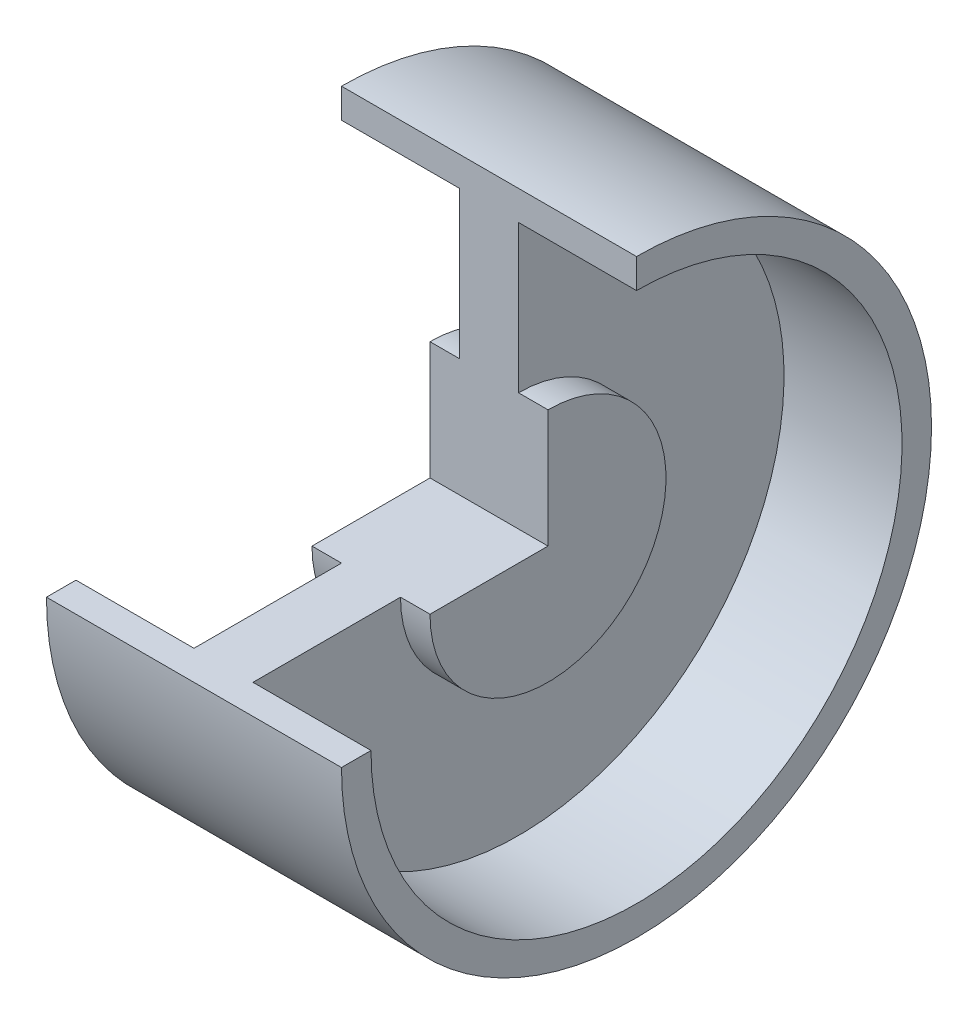
ISO-10303-21;
HEADER;
FILE_DESCRIPTION(('STEP AP214'),'2;1');
FILE_NAME('part.step','',(''),(''),'','','');
FILE_SCHEMA(('AUTOMOTIVE_DESIGN { 1 0 10303 214 1 1 1 1 }'));
ENDSEC;
DATA;
#1=APPLICATION_CONTEXT('core data for automotive mechanical design processes');
#2=APPLICATION_PROTOCOL_DEFINITION('international standard','automotive_design',2000,#1);
#3=PRODUCT_CONTEXT('',#1,'mechanical');
#4=PRODUCT('Part','Part','',(#3));
#5=PRODUCT_RELATED_PRODUCT_CATEGORY('part','',(#4));
#6=PRODUCT_DEFINITION_FORMATION('','',#4);
#7=PRODUCT_DEFINITION_CONTEXT('part definition',#1,'design');
#8=PRODUCT_DEFINITION('design','',#6,#7);
#9=PRODUCT_DEFINITION_SHAPE('','',#8);
#10=(LENGTH_UNIT() NAMED_UNIT(*) SI_UNIT(.MILLI.,.METRE.));
#11=(NAMED_UNIT(*) PLANE_ANGLE_UNIT() SI_UNIT($,.RADIAN.));
#12=(NAMED_UNIT(*) SI_UNIT($,.STERADIAN.) SOLID_ANGLE_UNIT());
#13=UNCERTAINTY_MEASURE_WITH_UNIT(LENGTH_MEASURE(1.E-05),#10,'distance_accuracy_value','');
#14=(GEOMETRIC_REPRESENTATION_CONTEXT(3) GLOBAL_UNCERTAINTY_ASSIGNED_CONTEXT((#13)) GLOBAL_UNIT_ASSIGNED_CONTEXT((#10,
#11,#12)) REPRESENTATION_CONTEXT('',''));
#15=CARTESIAN_POINT('',(0.,0.,0.));
#16=DIRECTION('',(0.,0.,1.));
#17=DIRECTION('',(1.,0.,0.));
#18=AXIS2_PLACEMENT_3D('',#15,#16,#17);
#19=CARTESIAN_POINT('',(9.99999999999999,0.,0.));
#20=DIRECTION('',(1.,0.,0.));
#21=DIRECTION('',(0.,1.,0.));
#22=AXIS2_PLACEMENT_3D('',#19,#20,#21);
#23=PLANE('',#22);
#24=CARTESIAN_POINT('',(9.99999999999998,0.,0.));
#25=DIRECTION('',(1.,0.,0.));
#26=DIRECTION('',(0.,1.,0.));
#27=AXIS2_PLACEMENT_3D('',#24,#25,#26);
#28=CIRCLE('',#27,20.);
#29=CARTESIAN_POINT('',(9.99999999999998,2.09488880330588E-13,20.));
#30=VERTEX_POINT('',#29);
#31=CARTESIAN_POINT('',(10.,20.,0.));
#32=VERTEX_POINT('',#31);
#33=EDGE_CURVE('E11',#30,#32,#28,.T.);
#34=ORIENTED_EDGE('',*,*,#33,.T.);
#35=DIRECTION('',(0.,1.,0.));
#36=VECTOR('',#35,1.);
#37=CARTESIAN_POINT('',(10.,0.,0.));
#38=LINE('',#37,#36);
#39=CARTESIAN_POINT('',(10.,0.,0.));
#40=VERTEX_POINT('',#39);
#41=EDGE_CURVE('E48',#40,#32,#38,.T.);
#42=ORIENTED_EDGE('',*,*,#41,.F.);
#43=DIRECTION('',(0.,0.,1.));
#44=VECTOR('',#43,1.);
#45=CARTESIAN_POINT('',(10.,0.,0.));
#46=LINE('',#45,#44);
#47=EDGE_CURVE('E115',#40,#30,#46,.T.);
#48=ORIENTED_EDGE('',*,*,#47,.T.);
#49=EDGE_LOOP('',(#34,#42,#48));
#50=FACE_BOUND('',#49,.T.);
#51=ADVANCED_FACE('F34',(#50),#23,.T.);
#52=CARTESIAN_POINT('',(-10.,0.,0.));
#53=DIRECTION('',(1.,0.,0.));
#54=DIRECTION('',(0.,1.,0.));
#55=AXIS2_PLACEMENT_3D('',#52,#53,#54);
#56=CYLINDRICAL_SURFACE('',#55,20.);
#57=CARTESIAN_POINT('',(4.99999999999998,0.,0.));
#58=DIRECTION('',(1.,0.,0.));
#59=DIRECTION('',(0.,1.,0.));
#60=AXIS2_PLACEMENT_3D('',#57,#58,#59);
#61=CIRCLE('',#60,20.);
#62=CARTESIAN_POINT('',(4.99999999999998,2.16427774234495E-13,20.));
#63=VERTEX_POINT('',#62);
#64=CARTESIAN_POINT('',(5.,20.,0.));
#65=VERTEX_POINT('',#64);
#66=EDGE_CURVE('E42',#63,#65,#61,.T.);
#67=ORIENTED_EDGE('',*,*,#66,.T.);
#68=DIRECTION('',(-1.,0.,0.));
#69=VECTOR('',#68,1.);
#70=CARTESIAN_POINT('',(10.,20.,0.));
#71=LINE('',#70,#69);
#72=EDGE_CURVE('E124',#32,#65,#71,.T.);
#73=ORIENTED_EDGE('',*,*,#72,.F.);
#74=ORIENTED_EDGE('',*,*,#33,.F.);
#75=DIRECTION('',(-1.,0.,0.));
#76=VECTOR('',#75,1.);
#77=CARTESIAN_POINT('',(9.99999999999998,2.09488880330588E-13,20.));
#78=LINE('',#77,#76);
#79=EDGE_CURVE('E155',#30,#63,#78,.T.);
#80=ORIENTED_EDGE('',*,*,#79,.T.);
#81=EDGE_LOOP('',(#67,#73,#74,#80));
#82=FACE_BOUND('',#81,.T.);
#83=ADVANCED_FACE('F36',(#82),#56,.T.);
#84=CARTESIAN_POINT('',(4.99999999999996,2.16427774234495E-13,20.));
#85=DIRECTION('',(1.,0.,0.));
#86=DIRECTION('',(0.,1.,0.));
#87=AXIS2_PLACEMENT_3D('',#84,#85,#86);
#88=PLANE('',#87);
#89=CARTESIAN_POINT('',(4.99999999999994,0.,0.));
#90=DIRECTION('',(1.,0.,0.));
#91=DIRECTION('',(0.,1.,0.));
#92=AXIS2_PLACEMENT_3D('',#89,#90,#91);
#93=CIRCLE('',#92,45.);
#94=CARTESIAN_POINT('',(4.99999999999994,4.7828887464773E-13,45.));
#95=VERTEX_POINT('',#94);
#96=CARTESIAN_POINT('',(5.,45.,0.));
#97=VERTEX_POINT('',#96);
#98=EDGE_CURVE('E199',#95,#97,#93,.T.);
#99=ORIENTED_EDGE('',*,*,#98,.T.);
#100=DIRECTION('',(0.,1.,0.));
#101=VECTOR('',#100,1.);
#102=CARTESIAN_POINT('',(5.,20.,0.));
#103=LINE('',#102,#101);
#104=EDGE_CURVE('E127',#65,#97,#103,.T.);
#105=ORIENTED_EDGE('',*,*,#104,.F.);
#106=ORIENTED_EDGE('',*,*,#66,.F.);
#107=DIRECTION('',(0.,0.,1.));
#108=VECTOR('',#107,1.);
#109=CARTESIAN_POINT('',(4.99999999999998,2.16427774234495E-13,20.));
#110=LINE('',#109,#108);
#111=EDGE_CURVE('E157',#63,#95,#110,.T.);
#112=ORIENTED_EDGE('',*,*,#111,.T.);
#113=EDGE_LOOP('',(#99,#105,#106,#112));
#114=FACE_BOUND('',#113,.T.);
#115=ADVANCED_FACE('F201',(#114),#88,.T.);
#116=CARTESIAN_POINT('',(-10.,0.,0.));
#117=DIRECTION('',(1.,0.,0.));
#118=DIRECTION('',(0.,1.,0.));
#119=AXIS2_PLACEMENT_3D('',#116,#117,#118);
#120=CYLINDRICAL_SURFACE('',#119,45.);
#121=CARTESIAN_POINT('',(24.9999999999999,0.,0.));
#122=DIRECTION('',(1.,0.,0.));
#123=DIRECTION('',(0.,1.,0.));
#124=AXIS2_PLACEMENT_3D('',#121,#122,#123);
#125=CIRCLE('',#124,45.);
#126=CARTESIAN_POINT('',(24.9999999999999,4.50533299032102E-13,45.));
#127=VERTEX_POINT('',#126);
#128=CARTESIAN_POINT('',(25.,45.,0.));
#129=VERTEX_POINT('',#128);
#130=EDGE_CURVE('E197',#127,#129,#125,.T.);
#131=ORIENTED_EDGE('',*,*,#130,.T.);
#132=DIRECTION('',(1.,0.,0.));
#133=VECTOR('',#132,1.);
#134=CARTESIAN_POINT('',(5.,45.,0.));
#135=LINE('',#134,#133);
#136=EDGE_CURVE('E129',#97,#129,#135,.T.);
#137=ORIENTED_EDGE('',*,*,#136,.F.);
#138=ORIENTED_EDGE('',*,*,#98,.F.);
#139=DIRECTION('',(1.,0.,0.));
#140=VECTOR('',#139,1.);
#141=CARTESIAN_POINT('',(4.99999999999994,4.7828887464773E-13,45.));
#142=LINE('',#141,#140);
#143=EDGE_CURVE('E160',#95,#127,#142,.T.);
#144=ORIENTED_EDGE('',*,*,#143,.T.);
#145=EDGE_LOOP('',(#131,#137,#138,#144));
#146=FACE_BOUND('',#145,.T.);
#147=ADVANCED_FACE('F207',(#146),#120,.F.);
#148=CARTESIAN_POINT('',(24.9999999999999,4.50533299032102E-13,45.));
#149=DIRECTION('',(1.,0.,0.));
#150=DIRECTION('',(0.,1.,0.));
#151=AXIS2_PLACEMENT_3D('',#148,#149,#150);
#152=PLANE('',#151);
#153=CARTESIAN_POINT('',(24.9999999999999,0.,0.));
#154=DIRECTION('',(1.,0.,0.));
#155=DIRECTION('',(0.,1.,0.));
#156=AXIS2_PLACEMENT_3D('',#153,#154,#155);
#157=CIRCLE('',#156,50.);
#158=CARTESIAN_POINT('',(24.9999999999999,5.02905519114749E-13,50.));
#159=VERTEX_POINT('',#158);
#160=CARTESIAN_POINT('',(25.,50.,0.));
#161=VERTEX_POINT('',#160);
#162=EDGE_CURVE('E195',#159,#161,#157,.T.);
#163=ORIENTED_EDGE('',*,*,#162,.T.);
#164=DIRECTION('',(0.,1.,0.));
#165=VECTOR('',#164,1.);
#166=CARTESIAN_POINT('',(25.,45.,0.));
#167=LINE('',#166,#165);
#168=EDGE_CURVE('E134',#129,#161,#167,.T.);
#169=ORIENTED_EDGE('',*,*,#168,.F.);
#170=ORIENTED_EDGE('',*,*,#130,.F.);
#171=DIRECTION('',(0.,0.,1.));
#172=VECTOR('',#171,1.);
#173=CARTESIAN_POINT('',(24.9999999999999,4.50533299032102E-13,45.));
#174=LINE('',#173,#172);
#175=EDGE_CURVE('E163',#127,#159,#174,.T.);
#176=ORIENTED_EDGE('',*,*,#175,.T.);
#177=EDGE_LOOP('',(#163,#169,#170,#176));
#178=FACE_BOUND('',#177,.T.);
#179=ADVANCED_FACE('F210',(#178),#152,.T.);
#180=CARTESIAN_POINT('',(-10.,0.,0.));
#181=DIRECTION('',(1.,0.,0.));
#182=DIRECTION('',(0.,1.,0.));
#183=AXIS2_PLACEMENT_3D('',#180,#181,#182);
#184=CYLINDRICAL_SURFACE('',#183,50.);
#185=CARTESIAN_POINT('',(-25.0000000000001,0.,0.));
#186=DIRECTION('',(1.,0.,0.));
#187=DIRECTION('',(0.,1.,0.));
#188=AXIS2_PLACEMENT_3D('',#185,#186,#187);
#189=CIRCLE('',#188,50.);
#190=CARTESIAN_POINT('',(-25.0000000000001,5.7229445815382E-13,50.));
#191=VERTEX_POINT('',#190);
#192=CARTESIAN_POINT('',(-25.,50.,0.));
#193=VERTEX_POINT('',#192);
#194=EDGE_CURVE('E193',#191,#193,#189,.T.);
#195=ORIENTED_EDGE('',*,*,#194,.T.);
#196=DIRECTION('',(-1.,0.,0.));
#197=VECTOR('',#196,1.);
#198=CARTESIAN_POINT('',(25.,50.,0.));
#199=LINE('',#198,#197);
#200=EDGE_CURVE('E137',#161,#193,#199,.T.);
#201=ORIENTED_EDGE('',*,*,#200,.F.);
#202=ORIENTED_EDGE('',*,*,#162,.F.);
#203=DIRECTION('',(-1.,0.,0.));
#204=VECTOR('',#203,1.);
#205=CARTESIAN_POINT('',(24.9999999999999,5.02905519114749E-13,50.));
#206=LINE('',#205,#204);
#207=EDGE_CURVE('E166',#159,#191,#206,.T.);
#208=ORIENTED_EDGE('',*,*,#207,.T.);
#209=EDGE_LOOP('',(#195,#201,#202,#208));
#210=FACE_BOUND('',#209,.T.);
#211=ADVANCED_FACE('F215',(#210),#184,.T.);
#212=CARTESIAN_POINT('',(-25.0000000000001,5.19922238071173E-13,45.));
#213=DIRECTION('',(-1.,0.,0.));
#214=DIRECTION('',(0.,-1.,0.));
#215=AXIS2_PLACEMENT_3D('',#212,#213,#214);
#216=PLANE('',#215);
#217=CARTESIAN_POINT('',(-25.0000000000001,0.,0.));
#218=DIRECTION('',(1.,0.,0.));
#219=DIRECTION('',(0.,1.,0.));
#220=AXIS2_PLACEMENT_3D('',#217,#218,#219);
#221=CIRCLE('',#220,45.);
#222=CARTESIAN_POINT('',(-25.0000000000001,5.19922238071173E-13,45.));
#223=VERTEX_POINT('',#222);
#224=CARTESIAN_POINT('',(-25.,45.,0.));
#225=VERTEX_POINT('',#224);
#226=EDGE_CURVE('E191',#223,#225,#221,.T.);
#227=ORIENTED_EDGE('',*,*,#226,.T.);
#228=DIRECTION('',(0.,-1.,0.));
#229=VECTOR('',#228,1.);
#230=CARTESIAN_POINT('',(-25.,45.,0.));
#231=LINE('',#230,#229);
#232=EDGE_CURVE('E140',#193,#225,#231,.T.);
#233=ORIENTED_EDGE('',*,*,#232,.F.);
#234=ORIENTED_EDGE('',*,*,#194,.F.);
#235=DIRECTION('',(0.,0.,-1.));
#236=VECTOR('',#235,1.);
#237=CARTESIAN_POINT('',(-25.0000000000001,5.19922238071173E-13,45.));
#238=LINE('',#237,#236);
#239=EDGE_CURVE('E169',#191,#223,#238,.T.);
#240=ORIENTED_EDGE('',*,*,#239,.T.);
#241=EDGE_LOOP('',(#227,#233,#234,#240));
#242=FACE_BOUND('',#241,.T.);
#243=ADVANCED_FACE('F218',(#242),#216,.T.);
#244=CARTESIAN_POINT('',(-10.,0.,0.));
#245=DIRECTION('',(1.,0.,0.));
#246=DIRECTION('',(0.,1.,0.));
#247=AXIS2_PLACEMENT_3D('',#244,#245,#246);
#248=CYLINDRICAL_SURFACE('',#247,45.);
#249=CARTESIAN_POINT('',(-5.00000000000007,0.,0.));
#250=DIRECTION('',(1.,0.,0.));
#251=DIRECTION('',(0.,1.,0.));
#252=AXIS2_PLACEMENT_3D('',#249,#250,#251);
#253=CIRCLE('',#252,45.);
#254=CARTESIAN_POINT('',(-5.00000000000007,4.92166662455544E-13,45.));
#255=VERTEX_POINT('',#254);
#256=CARTESIAN_POINT('',(-5.,45.,0.));
#257=VERTEX_POINT('',#256);
#258=EDGE_CURVE('E189',#255,#257,#253,.T.);
#259=ORIENTED_EDGE('',*,*,#258,.T.);
#260=DIRECTION('',(1.,0.,0.));
#261=VECTOR('',#260,1.);
#262=CARTESIAN_POINT('',(-5.,45.,0.));
#263=LINE('',#262,#261);
#264=EDGE_CURVE('E143',#225,#257,#263,.T.);
#265=ORIENTED_EDGE('',*,*,#264,.F.);
#266=ORIENTED_EDGE('',*,*,#226,.F.);
#267=DIRECTION('',(1.,0.,0.));
#268=VECTOR('',#267,1.);
#269=CARTESIAN_POINT('',(-5.00000000000007,4.92166662455544E-13,45.));
#270=LINE('',#269,#268);
#271=EDGE_CURVE('E172',#223,#255,#270,.T.);
#272=ORIENTED_EDGE('',*,*,#271,.T.);
#273=EDGE_LOOP('',(#259,#265,#266,#272));
#274=FACE_BOUND('',#273,.T.);
#275=ADVANCED_FACE('F223',(#274),#248,.F.);
#276=CARTESIAN_POINT('',(-5.00000000000005,2.3030556204231E-13,20.));
#277=DIRECTION('',(-1.,0.,0.));
#278=DIRECTION('',(0.,-1.,0.));
#279=AXIS2_PLACEMENT_3D('',#276,#277,#278);
#280=PLANE('',#279);
#281=CARTESIAN_POINT('',(-5.00000000000003,0.,0.));
#282=DIRECTION('',(1.,0.,0.));
#283=DIRECTION('',(0.,1.,0.));
#284=AXIS2_PLACEMENT_3D('',#281,#282,#283);
#285=CIRCLE('',#284,20.);
#286=CARTESIAN_POINT('',(-5.00000000000003,2.3030556204231E-13,20.));
#287=VERTEX_POINT('',#286);
#288=CARTESIAN_POINT('',(-5.,20.,0.));
#289=VERTEX_POINT('',#288);
#290=EDGE_CURVE('E187',#287,#289,#285,.T.);
#291=ORIENTED_EDGE('',*,*,#290,.T.);
#292=DIRECTION('',(0.,-1.,0.));
#293=VECTOR('',#292,1.);
#294=CARTESIAN_POINT('',(-5.,20.,0.));
#295=LINE('',#294,#293);
#296=EDGE_CURVE('E146',#257,#289,#295,.T.);
#297=ORIENTED_EDGE('',*,*,#296,.F.);
#298=ORIENTED_EDGE('',*,*,#258,.F.);
#299=DIRECTION('',(0.,0.,-1.));
#300=VECTOR('',#299,1.);
#301=CARTESIAN_POINT('',(-5.00000000000003,2.3030556204231E-13,20.));
#302=LINE('',#301,#300);
#303=EDGE_CURVE('E175',#255,#287,#302,.T.);
#304=ORIENTED_EDGE('',*,*,#303,.T.);
#305=EDGE_LOOP('',(#291,#297,#298,#304));
#306=FACE_BOUND('',#305,.T.);
#307=ADVANCED_FACE('F226',(#306),#280,.T.);
#308=CARTESIAN_POINT('',(-10.,0.,0.));
#309=DIRECTION('',(1.,0.,0.));
#310=DIRECTION('',(0.,1.,0.));
#311=AXIS2_PLACEMENT_3D('',#308,#309,#310);
#312=CYLINDRICAL_SURFACE('',#311,20.);
#313=CARTESIAN_POINT('',(-10.,0.,0.));
#314=DIRECTION('',(1.,0.,0.));
#315=DIRECTION('',(0.,1.,0.));
#316=AXIS2_PLACEMENT_3D('',#313,#314,#315);
#317=CIRCLE('',#316,20.);
#318=CARTESIAN_POINT('',(-10.,2.37244455946217E-13,20.));
#319=VERTEX_POINT('',#318);
#320=CARTESIAN_POINT('',(-10.,20.,0.));
#321=VERTEX_POINT('',#320);
#322=EDGE_CURVE('E185',#319,#321,#317,.T.);
#323=ORIENTED_EDGE('',*,*,#322,.T.);
#324=DIRECTION('',(-1.,0.,0.));
#325=VECTOR('',#324,1.);
#326=CARTESIAN_POINT('',(-10.,20.,0.));
#327=LINE('',#326,#325);
#328=EDGE_CURVE('E149',#289,#321,#327,.T.);
#329=ORIENTED_EDGE('',*,*,#328,.F.);
#330=ORIENTED_EDGE('',*,*,#290,.F.);
#331=DIRECTION('',(-1.,0.,0.));
#332=VECTOR('',#331,1.);
#333=CARTESIAN_POINT('',(-10.,2.37244455946217E-13,20.));
#334=LINE('',#333,#332);
#335=EDGE_CURVE('E178',#287,#319,#334,.T.);
#336=ORIENTED_EDGE('',*,*,#335,.T.);
#337=EDGE_LOOP('',(#323,#329,#330,#336));
#338=FACE_BOUND('',#337,.T.);
#339=ADVANCED_FACE('F231',(#338),#312,.T.);
#340=CARTESIAN_POINT('',(-10.,0.,0.));
#341=DIRECTION('',(-1.,0.,0.));
#342=DIRECTION('',(0.,-1.,0.));
#343=AXIS2_PLACEMENT_3D('',#340,#341,#342);
#344=PLANE('',#343);
#345=DIRECTION('',(0.,-1.,0.));
#346=VECTOR('',#345,1.);
#347=CARTESIAN_POINT('',(-10.,0.,0.));
#348=LINE('',#347,#346);
#349=CARTESIAN_POINT('',(-10.,0.,0.));
#350=VERTEX_POINT('',#349);
#351=EDGE_CURVE('E152',#321,#350,#348,.T.);
#352=ORIENTED_EDGE('',*,*,#351,.F.);
#353=ORIENTED_EDGE('',*,*,#322,.F.);
#354=DIRECTION('',(0.,0.,-1.));
#355=VECTOR('',#354,1.);
#356=CARTESIAN_POINT('',(-10.,0.,0.));
#357=LINE('',#356,#355);
#358=EDGE_CURVE('E181',#319,#350,#357,.T.);
#359=ORIENTED_EDGE('',*,*,#358,.T.);
#360=EDGE_LOOP('',(#352,#353,#359));
#361=FACE_BOUND('',#360,.T.);
#362=ADVANCED_FACE('F233',(#361),#344,.T.);
#363=CARTESIAN_POINT('',(0.,0.,0.));
#364=DIRECTION('',(0.,-1.,0.));
#365=DIRECTION('',(1.,0.,0.));
#366=AXIS2_PLACEMENT_3D('',#363,#364,#365);
#367=PLANE('',#366);
#368=ORIENTED_EDGE('',*,*,#47,.F.);
#369=DIRECTION('',(1.,0.,0.));
#370=VECTOR('',#369,1.);
#371=CARTESIAN_POINT('',(-10.,0.,0.));
#372=LINE('',#371,#370);
#373=EDGE_CURVE('E55',#350,#40,#372,.T.);
#374=ORIENTED_EDGE('',*,*,#373,.F.);
#375=ORIENTED_EDGE('',*,*,#358,.F.);
#376=ORIENTED_EDGE('',*,*,#335,.F.);
#377=ORIENTED_EDGE('',*,*,#303,.F.);
#378=ORIENTED_EDGE('',*,*,#271,.F.);
#379=ORIENTED_EDGE('',*,*,#239,.F.);
#380=ORIENTED_EDGE('',*,*,#207,.F.);
#381=ORIENTED_EDGE('',*,*,#175,.F.);
#382=ORIENTED_EDGE('',*,*,#143,.F.);
#383=ORIENTED_EDGE('',*,*,#111,.F.);
#384=ORIENTED_EDGE('',*,*,#79,.F.);
#385=EDGE_LOOP('',(#368,#374,#375,#376,#377,#378,#379,#380,#381,#382,#383,#384));
#386=FACE_BOUND('',#385,.T.);
#387=ADVANCED_FACE('F234',(#386),#367,.F.);
#388=CARTESIAN_POINT('',(0.,0.,0.));
#389=DIRECTION('',(0.,0.,1.));
#390=DIRECTION('',(1.,0.,0.));
#391=AXIS2_PLACEMENT_3D('',#388,#389,#390);
#392=PLANE('',#391);
#393=ORIENTED_EDGE('',*,*,#41,.T.);
#394=ORIENTED_EDGE('',*,*,#72,.T.);
#395=ORIENTED_EDGE('',*,*,#104,.T.);
#396=ORIENTED_EDGE('',*,*,#136,.T.);
#397=ORIENTED_EDGE('',*,*,#168,.T.);
#398=ORIENTED_EDGE('',*,*,#200,.T.);
#399=ORIENTED_EDGE('',*,*,#232,.T.);
#400=ORIENTED_EDGE('',*,*,#264,.T.);
#401=ORIENTED_EDGE('',*,*,#296,.T.);
#402=ORIENTED_EDGE('',*,*,#328,.T.);
#403=ORIENTED_EDGE('',*,*,#351,.T.);
#404=ORIENTED_EDGE('',*,*,#373,.T.);
#405=EDGE_LOOP('',(#393,#394,#395,#396,#397,#398,#399,#400,#401,#402,#403,#404));
#406=FACE_BOUND('',#405,.T.);
#407=ADVANCED_FACE('F122',(#406),#392,.T.);
#408=CLOSED_SHELL('',(#51,#83,#115,#147,#179,#211,#243,#275,#307,#339,#362,#387,#407));
#409=MANIFOLD_SOLID_BREP('B2',#408);
#410=ADVANCED_BREP_SHAPE_REPRESENTATION('',(#18,#409),#14);
#411=SHAPE_DEFINITION_REPRESENTATION(#9,#410);
ENDSEC;
END-ISO-10303-21;
